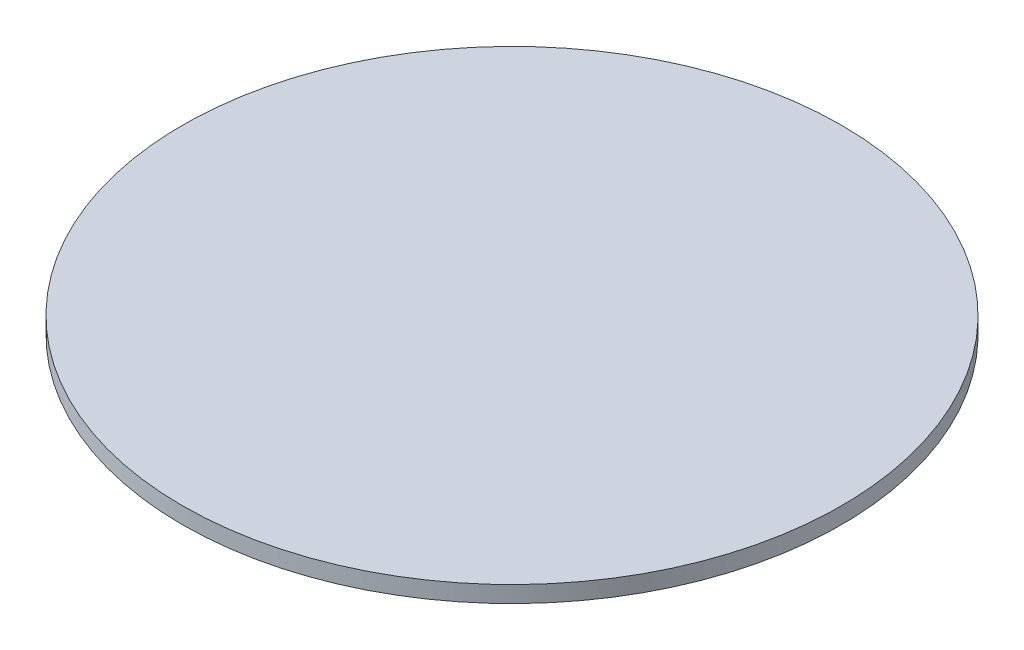
ISO-10303-21;
HEADER;
FILE_DESCRIPTION(('STEP AP214'),'2;1');
FILE_NAME('part.step','',(''),(''),'','','');
FILE_SCHEMA(('AUTOMOTIVE_DESIGN { 1 0 10303 214 1 1 1 1 }'));
ENDSEC;
DATA;
#1=APPLICATION_CONTEXT('core data for automotive mechanical design processes');
#2=APPLICATION_PROTOCOL_DEFINITION('international standard','automotive_design',2000,#1);
#3=PRODUCT_CONTEXT('',#1,'mechanical');
#4=PRODUCT('Part','Part','',(#3));
#5=PRODUCT_RELATED_PRODUCT_CATEGORY('part','',(#4));
#6=PRODUCT_DEFINITION_FORMATION('','',#4);
#7=PRODUCT_DEFINITION_CONTEXT('part definition',#1,'design');
#8=PRODUCT_DEFINITION('design','',#6,#7);
#9=PRODUCT_DEFINITION_SHAPE('','',#8);
#10=(LENGTH_UNIT() NAMED_UNIT(*) SI_UNIT(.MILLI.,.METRE.));
#11=(NAMED_UNIT(*) PLANE_ANGLE_UNIT() SI_UNIT($,.RADIAN.));
#12=(NAMED_UNIT(*) SI_UNIT($,.STERADIAN.) SOLID_ANGLE_UNIT());
#13=UNCERTAINTY_MEASURE_WITH_UNIT(LENGTH_MEASURE(1.E-05),#10,'distance_accuracy_value','');
#14=(GEOMETRIC_REPRESENTATION_CONTEXT(3) GLOBAL_UNCERTAINTY_ASSIGNED_CONTEXT((#13)) GLOBAL_UNIT_ASSIGNED_CONTEXT((#10,
#11,#12)) REPRESENTATION_CONTEXT('',''));
#15=CARTESIAN_POINT('',(0.,0.,0.));
#16=DIRECTION('',(0.,0.,1.));
#17=DIRECTION('',(1.,0.,0.));
#18=AXIS2_PLACEMENT_3D('',#15,#16,#17);
#19=CARTESIAN_POINT('',(0.,1.25,0.));
#20=DIRECTION('',(0.,-1.,0.));
#21=DIRECTION('',(0.,0.,-1.));
#22=AXIS2_PLACEMENT_3D('',#19,#20,#21);
#23=CYLINDRICAL_SURFACE('',#22,25.);
#24=CARTESIAN_POINT('',(0.,1.25,0.));
#25=DIRECTION('',(0.,1.,0.));
#26=DIRECTION('',(0.,0.,1.));
#27=AXIS2_PLACEMENT_3D('',#24,#25,#26);
#28=CIRCLE('',#27,25.);
#29=CARTESIAN_POINT('',(0.,1.25,25.));
#30=VERTEX_POINT('',#29);
#31=EDGE_CURVE('E10',#30,#30,#28,.T.);
#32=ORIENTED_EDGE('',*,*,#31,.F.);
#33=EDGE_LOOP('',(#32));
#34=FACE_BOUND('',#33,.T.);
#35=CARTESIAN_POINT('',(0.,0.,0.));
#36=DIRECTION('',(0.,1.,0.));
#37=DIRECTION('',(0.,0.,1.));
#38=AXIS2_PLACEMENT_3D('',#35,#36,#37);
#39=CIRCLE('',#38,25.);
#40=CARTESIAN_POINT('',(0.,0.,25.));
#41=VERTEX_POINT('',#40);
#42=EDGE_CURVE('E36',#41,#41,#39,.T.);
#43=ORIENTED_EDGE('',*,*,#42,.T.);
#44=EDGE_LOOP('',(#43));
#45=FACE_BOUND('',#44,.T.);
#46=ADVANCED_FACE('F33',(#34,#45),#23,.T.);
#47=CARTESIAN_POINT('',(0.,1.25,0.));
#48=DIRECTION('',(0.,1.,0.));
#49=DIRECTION('',(0.,0.,1.));
#50=AXIS2_PLACEMENT_3D('',#47,#48,#49);
#51=PLANE('',#50);
#52=ORIENTED_EDGE('',*,*,#31,.T.);
#53=EDGE_LOOP('',(#52));
#54=FACE_BOUND('',#53,.T.);
#55=ADVANCED_FACE('F48',(#54),#51,.T.);
#56=CARTESIAN_POINT('',(0.,0.,0.));
#57=DIRECTION('',(0.,1.,0.));
#58=DIRECTION('',(0.,0.,1.));
#59=AXIS2_PLACEMENT_3D('',#56,#57,#58);
#60=PLANE('',#59);
#61=ORIENTED_EDGE('',*,*,#42,.F.);
#62=EDGE_LOOP('',(#61));
#63=FACE_BOUND('',#62,.T.);
#64=ADVANCED_FACE('F46',(#63),#60,.F.);
#65=CLOSED_SHELL('',(#46,#55,#64));
#66=MANIFOLD_SOLID_BREP('B2',#65);
#67=ADVANCED_BREP_SHAPE_REPRESENTATION('',(#18,#66),#14);
#68=SHAPE_DEFINITION_REPRESENTATION(#9,#67);
ENDSEC;
END-ISO-10303-21;
